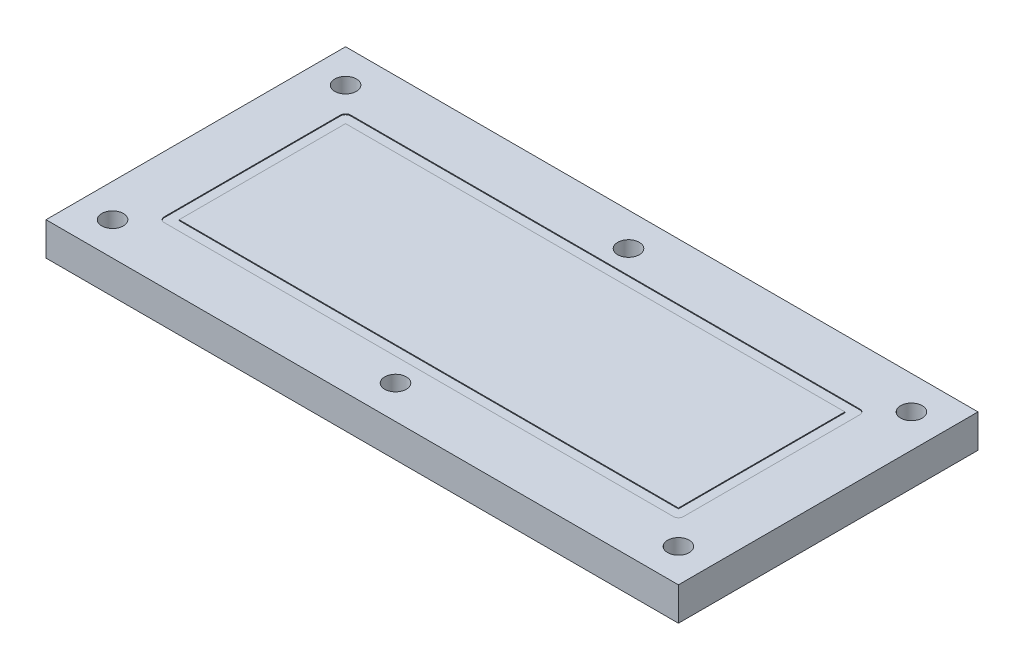
ISO-10303-21;
HEADER;
FILE_DESCRIPTION(('STEP AP214'),'2;1');
FILE_NAME('part.step','',(''),(''),'','','');
FILE_SCHEMA(('AUTOMOTIVE_DESIGN { 1 0 10303 214 1 1 1 1 }'));
ENDSEC;
DATA;
#1=APPLICATION_CONTEXT('core data for automotive mechanical design processes');
#2=APPLICATION_PROTOCOL_DEFINITION('international standard','automotive_design',2000,#1);
#3=PRODUCT_CONTEXT('',#1,'mechanical');
#4=PRODUCT('Part','Part','',(#3));
#5=PRODUCT_RELATED_PRODUCT_CATEGORY('part','',(#4));
#6=PRODUCT_DEFINITION_FORMATION('','',#4);
#7=PRODUCT_DEFINITION_CONTEXT('part definition',#1,'design');
#8=PRODUCT_DEFINITION('design','',#6,#7);
#9=PRODUCT_DEFINITION_SHAPE('','',#8);
#10=(LENGTH_UNIT() NAMED_UNIT(*) SI_UNIT(.MILLI.,.METRE.));
#11=(NAMED_UNIT(*) PLANE_ANGLE_UNIT() SI_UNIT($,.RADIAN.));
#12=(NAMED_UNIT(*) SI_UNIT($,.STERADIAN.) SOLID_ANGLE_UNIT());
#13=UNCERTAINTY_MEASURE_WITH_UNIT(LENGTH_MEASURE(1.E-05),#10,'distance_accuracy_value','');
#14=(GEOMETRIC_REPRESENTATION_CONTEXT(3) GLOBAL_UNCERTAINTY_ASSIGNED_CONTEXT((#13)) GLOBAL_UNIT_ASSIGNED_CONTEXT((#10,
#11,#12)) REPRESENTATION_CONTEXT('',''));
#15=CARTESIAN_POINT('',(0.,0.,0.));
#16=DIRECTION('',(0.,0.,1.));
#17=DIRECTION('',(1.,0.,0.));
#18=AXIS2_PLACEMENT_3D('',#15,#16,#17);
#19=CARTESIAN_POINT('',(190.,20.,90.));
#20=DIRECTION('',(-1.,0.,0.));
#21=DIRECTION('',(0.,0.,1.));
#22=AXIS2_PLACEMENT_3D('',#19,#20,#21);
#23=PLANE('',#22);
#24=DIRECTION('',(0.,0.,-1.));
#25=VECTOR('',#24,1.);
#26=CARTESIAN_POINT('',(190.,0.,90.));
#27=LINE('',#26,#25);
#28=CARTESIAN_POINT('',(190.,0.,90.));
#29=VERTEX_POINT('',#28);
#30=CARTESIAN_POINT('',(190.,0.,-90.));
#31=VERTEX_POINT('',#30);
#32=EDGE_CURVE('E285',#29,#31,#27,.T.);
#33=ORIENTED_EDGE('',*,*,#32,.T.);
#34=DIRECTION('',(0.,-1.,0.));
#35=VECTOR('',#34,1.);
#36=CARTESIAN_POINT('',(190.,20.,-90.));
#37=LINE('',#36,#35);
#38=CARTESIAN_POINT('',(190.,20.,-90.));
#39=VERTEX_POINT('',#38);
#40=EDGE_CURVE('E11',#39,#31,#37,.T.);
#41=ORIENTED_EDGE('',*,*,#40,.F.);
#42=DIRECTION('',(0.,0.,-1.));
#43=VECTOR('',#42,1.);
#44=CARTESIAN_POINT('',(190.,20.,90.));
#45=LINE('',#44,#43);
#46=CARTESIAN_POINT('',(190.,20.,90.));
#47=VERTEX_POINT('',#46);
#48=EDGE_CURVE('E288',#47,#39,#45,.T.);
#49=ORIENTED_EDGE('',*,*,#48,.F.);
#50=DIRECTION('',(0.,-1.,0.));
#51=VECTOR('',#50,1.);
#52=CARTESIAN_POINT('',(190.,20.,90.));
#53=LINE('',#52,#51);
#54=EDGE_CURVE('E298',#47,#29,#53,.T.);
#55=ORIENTED_EDGE('',*,*,#54,.T.);
#56=EDGE_LOOP('',(#33,#41,#49,#55));
#57=FACE_BOUND('',#56,.T.);
#58=ADVANCED_FACE('F36',(#57),#23,.F.);
#59=CARTESIAN_POINT('',(-190.,20.,-90.));
#60=DIRECTION('',(0.,0.,1.));
#61=DIRECTION('',(1.,0.,0.));
#62=AXIS2_PLACEMENT_3D('',#59,#60,#61);
#63=PLANE('',#62);
#64=DIRECTION('',(-1.,0.,0.));
#65=VECTOR('',#64,1.);
#66=CARTESIAN_POINT('',(-190.,0.,-90.));
#67=LINE('',#66,#65);
#68=CARTESIAN_POINT('',(-190.,0.,-90.));
#69=VERTEX_POINT('',#68);
#70=EDGE_CURVE('E301',#31,#69,#67,.T.);
#71=ORIENTED_EDGE('',*,*,#70,.T.);
#72=DIRECTION('',(0.,-1.,0.));
#73=VECTOR('',#72,1.);
#74=CARTESIAN_POINT('',(-190.,20.,-90.));
#75=LINE('',#74,#73);
#76=CARTESIAN_POINT('',(-190.,20.,-90.));
#77=VERTEX_POINT('',#76);
#78=EDGE_CURVE('E43',#77,#69,#75,.T.);
#79=ORIENTED_EDGE('',*,*,#78,.F.);
#80=DIRECTION('',(-1.,0.,0.));
#81=VECTOR('',#80,1.);
#82=CARTESIAN_POINT('',(-190.,20.,-90.));
#83=LINE('',#82,#81);
#84=EDGE_CURVE('E291',#39,#77,#83,.T.);
#85=ORIENTED_EDGE('',*,*,#84,.F.);
#86=ORIENTED_EDGE('',*,*,#40,.T.);
#87=EDGE_LOOP('',(#71,#79,#85,#86));
#88=FACE_BOUND('',#87,.T.);
#89=ADVANCED_FACE('F331',(#88),#63,.F.);
#90=CARTESIAN_POINT('',(-190.,20.,90.));
#91=DIRECTION('',(1.,0.,0.));
#92=DIRECTION('',(0.,0.,-1.));
#93=AXIS2_PLACEMENT_3D('',#90,#91,#92);
#94=PLANE('',#93);
#95=DIRECTION('',(0.,0.,1.));
#96=VECTOR('',#95,1.);
#97=CARTESIAN_POINT('',(-190.,0.,90.));
#98=LINE('',#97,#96);
#99=CARTESIAN_POINT('',(-190.,0.,90.));
#100=VERTEX_POINT('',#99);
#101=EDGE_CURVE('E303',#69,#100,#98,.T.);
#102=ORIENTED_EDGE('',*,*,#101,.T.);
#103=DIRECTION('',(0.,-1.,0.));
#104=VECTOR('',#103,1.);
#105=CARTESIAN_POINT('',(-190.,20.,90.));
#106=LINE('',#105,#104);
#107=CARTESIAN_POINT('',(-190.,20.,90.));
#108=VERTEX_POINT('',#107);
#109=EDGE_CURVE('E308',#108,#100,#106,.T.);
#110=ORIENTED_EDGE('',*,*,#109,.F.);
#111=DIRECTION('',(0.,0.,1.));
#112=VECTOR('',#111,1.);
#113=CARTESIAN_POINT('',(-190.,20.,90.));
#114=LINE('',#113,#112);
#115=EDGE_CURVE('E294',#77,#108,#114,.T.);
#116=ORIENTED_EDGE('',*,*,#115,.F.);
#117=ORIENTED_EDGE('',*,*,#78,.T.);
#118=EDGE_LOOP('',(#102,#110,#116,#117));
#119=FACE_BOUND('',#118,.T.);
#120=ADVANCED_FACE('F315',(#119),#94,.F.);
#121=CARTESIAN_POINT('',(-190.,20.,90.));
#122=DIRECTION('',(0.,0.,-1.));
#123=DIRECTION('',(-1.,0.,0.));
#124=AXIS2_PLACEMENT_3D('',#121,#122,#123);
#125=PLANE('',#124);
#126=DIRECTION('',(1.,0.,0.));
#127=VECTOR('',#126,1.);
#128=CARTESIAN_POINT('',(-190.,0.,90.));
#129=LINE('',#128,#127);
#130=EDGE_CURVE('E292',#100,#29,#129,.T.);
#131=ORIENTED_EDGE('',*,*,#130,.T.);
#132=ORIENTED_EDGE('',*,*,#54,.F.);
#133=DIRECTION('',(1.,0.,0.));
#134=VECTOR('',#133,1.);
#135=CARTESIAN_POINT('',(-190.,20.,90.));
#136=LINE('',#135,#134);
#137=EDGE_CURVE('E296',#108,#47,#136,.T.);
#138=ORIENTED_EDGE('',*,*,#137,.F.);
#139=ORIENTED_EDGE('',*,*,#109,.T.);
#140=EDGE_LOOP('',(#131,#132,#138,#139));
#141=FACE_BOUND('',#140,.T.);
#142=ADVANCED_FACE('F324',(#141),#125,.F.);
#143=CARTESIAN_POINT('',(0.,20.,0.));
#144=DIRECTION('',(0.,-1.,0.));
#145=DIRECTION('',(0.,0.,-1.));
#146=AXIS2_PLACEMENT_3D('',#143,#144,#145);
#147=PLANE('',#146);
#148=DIRECTION('',(-1.,0.,0.));
#149=VECTOR('',#148,1.);
#150=CARTESIAN_POINT('',(-153.,20.,-56.));
#151=LINE('',#150,#149);
#152=CARTESIAN_POINT('',(153.,20.,-56.));
#153=VERTEX_POINT('',#152);
#154=CARTESIAN_POINT('',(-153.,20.,-56.));
#155=VERTEX_POINT('',#154);
#156=EDGE_CURVE('E216',#153,#155,#151,.T.);
#157=ORIENTED_EDGE('',*,*,#156,.F.);
#158=CARTESIAN_POINT('',(153.,20.,-53.));
#159=DIRECTION('',(0.,1.,0.));
#160=DIRECTION('',(0.,0.,-1.));
#161=AXIS2_PLACEMENT_3D('',#158,#159,#160);
#162=CIRCLE('',#161,3.);
#163=CARTESIAN_POINT('',(156.,20.,-53.));
#164=VERTEX_POINT('',#163);
#165=EDGE_CURVE('E50',#164,#153,#162,.T.);
#166=ORIENTED_EDGE('',*,*,#165,.F.);
#167=DIRECTION('',(0.,0.,-1.));
#168=VECTOR('',#167,1.);
#169=CARTESIAN_POINT('',(156.,20.,52.9999999999999));
#170=LINE('',#169,#168);
#171=CARTESIAN_POINT('',(156.,20.,52.9999999999999));
#172=VERTEX_POINT('',#171);
#173=EDGE_CURVE('E193',#172,#164,#170,.T.);
#174=ORIENTED_EDGE('',*,*,#173,.F.);
#175=CARTESIAN_POINT('',(153.,20.,52.9999999999999));
#176=DIRECTION('',(0.,1.,0.));
#177=DIRECTION('',(0.,0.,1.));
#178=AXIS2_PLACEMENT_3D('',#175,#176,#177);
#179=CIRCLE('',#178,3.);
#180=CARTESIAN_POINT('',(153.,20.,55.9999999999999));
#181=VERTEX_POINT('',#180);
#182=EDGE_CURVE('E231',#181,#172,#179,.T.);
#183=ORIENTED_EDGE('',*,*,#182,.F.);
#184=DIRECTION('',(1.,0.,0.));
#185=VECTOR('',#184,1.);
#186=CARTESIAN_POINT('',(-153.,20.,55.9999999999999));
#187=LINE('',#186,#185);
#188=CARTESIAN_POINT('',(-153.,20.,55.9999999999999));
#189=VERTEX_POINT('',#188);
#190=EDGE_CURVE('E228',#189,#181,#187,.T.);
#191=ORIENTED_EDGE('',*,*,#190,.F.);
#192=CARTESIAN_POINT('',(-153.,20.,52.9999999999999));
#193=DIRECTION('',(0.,1.,0.));
#194=DIRECTION('',(0.,0.,-1.));
#195=AXIS2_PLACEMENT_3D('',#192,#193,#194);
#196=CIRCLE('',#195,3.);
#197=CARTESIAN_POINT('',(-156.,20.,52.9999999999999));
#198=VERTEX_POINT('',#197);
#199=EDGE_CURVE('E225',#198,#189,#196,.T.);
#200=ORIENTED_EDGE('',*,*,#199,.F.);
#201=DIRECTION('',(0.,0.,1.));
#202=VECTOR('',#201,1.);
#203=CARTESIAN_POINT('',(-156.,20.,52.9999999999999));
#204=LINE('',#203,#202);
#205=CARTESIAN_POINT('',(-156.,20.,-53.));
#206=VERTEX_POINT('',#205);
#207=EDGE_CURVE('E222',#206,#198,#204,.T.);
#208=ORIENTED_EDGE('',*,*,#207,.F.);
#209=CARTESIAN_POINT('',(-153.,20.,-53.));
#210=DIRECTION('',(0.,1.,0.));
#211=DIRECTION('',(0.,0.,-1.));
#212=AXIS2_PLACEMENT_3D('',#209,#210,#211);
#213=CIRCLE('',#212,3.);
#214=EDGE_CURVE('E219',#155,#206,#213,.T.);
#215=ORIENTED_EDGE('',*,*,#214,.F.);
#216=EDGE_LOOP('',(#157,#166,#174,#183,#191,#200,#208,#215));
#217=FACE_BOUND('',#216,.T.);
#218=CARTESIAN_POINT('',(170.,20.,70.));
#219=DIRECTION('',(0.,1.,0.));
#220=DIRECTION('',(0.,0.,-1.));
#221=AXIS2_PLACEMENT_3D('',#218,#219,#220);
#222=CIRCLE('',#221,6.50000000000002);
#223=CARTESIAN_POINT('',(170.,20.,63.5));
#224=VERTEX_POINT('',#223);
#225=EDGE_CURVE('E255',#224,#224,#222,.T.);
#226=ORIENTED_EDGE('',*,*,#225,.F.);
#227=EDGE_LOOP('',(#226));
#228=FACE_BOUND('',#227,.T.);
#229=CARTESIAN_POINT('',(0.,20.,-70.));
#230=DIRECTION('',(0.,1.,0.));
#231=DIRECTION('',(0.,0.,1.));
#232=AXIS2_PLACEMENT_3D('',#229,#230,#231);
#233=CIRCLE('',#232,6.50000000000001);
#234=CARTESIAN_POINT('',(0.,20.,-63.5));
#235=VERTEX_POINT('',#234);
#236=EDGE_CURVE('E262',#235,#235,#233,.T.);
#237=ORIENTED_EDGE('',*,*,#236,.F.);
#238=EDGE_LOOP('',(#237));
#239=FACE_BOUND('',#238,.T.);
#240=CARTESIAN_POINT('',(0.,20.,70.));
#241=DIRECTION('',(0.,1.,0.));
#242=DIRECTION('',(0.,0.,1.));
#243=AXIS2_PLACEMENT_3D('',#240,#241,#242);
#244=CIRCLE('',#243,6.5);
#245=CARTESIAN_POINT('',(0.,20.,76.5));
#246=VERTEX_POINT('',#245);
#247=EDGE_CURVE('E261',#246,#246,#244,.T.);
#248=ORIENTED_EDGE('',*,*,#247,.F.);
#249=EDGE_LOOP('',(#248));
#250=FACE_BOUND('',#249,.T.);
#251=CARTESIAN_POINT('',(-170.,20.,70.));
#252=DIRECTION('',(0.,1.,0.));
#253=DIRECTION('',(0.,0.,1.));
#254=AXIS2_PLACEMENT_3D('',#251,#252,#253);
#255=CIRCLE('',#254,6.50000000000002);
#256=CARTESIAN_POINT('',(-170.,20.,76.5));
#257=VERTEX_POINT('',#256);
#258=EDGE_CURVE('E274',#257,#257,#255,.T.);
#259=ORIENTED_EDGE('',*,*,#258,.F.);
#260=EDGE_LOOP('',(#259));
#261=FACE_BOUND('',#260,.T.);
#262=CARTESIAN_POINT('',(170.,20.,-70.));
#263=DIRECTION('',(0.,1.,0.));
#264=DIRECTION('',(0.,0.,-1.));
#265=AXIS2_PLACEMENT_3D('',#262,#263,#264);
#266=CIRCLE('',#265,6.50000000000002);
#267=CARTESIAN_POINT('',(170.,20.,-76.5));
#268=VERTEX_POINT('',#267);
#269=EDGE_CURVE('E238',#268,#268,#266,.T.);
#270=ORIENTED_EDGE('',*,*,#269,.F.);
#271=EDGE_LOOP('',(#270));
#272=FACE_BOUND('',#271,.T.);
#273=CARTESIAN_POINT('',(-170.,20.,-70.));
#274=DIRECTION('',(0.,1.,0.));
#275=DIRECTION('',(0.,0.,1.));
#276=AXIS2_PLACEMENT_3D('',#273,#274,#275);
#277=CIRCLE('',#276,6.50000000000002);
#278=CARTESIAN_POINT('',(-170.,20.,-63.5));
#279=VERTEX_POINT('',#278);
#280=EDGE_CURVE('E273',#279,#279,#277,.T.);
#281=ORIENTED_EDGE('',*,*,#280,.F.);
#282=EDGE_LOOP('',(#281));
#283=FACE_BOUND('',#282,.T.);
#284=ORIENTED_EDGE('',*,*,#48,.T.);
#285=ORIENTED_EDGE('',*,*,#84,.T.);
#286=ORIENTED_EDGE('',*,*,#115,.T.);
#287=ORIENTED_EDGE('',*,*,#137,.T.);
#288=EDGE_LOOP('',(#284,#285,#286,#287));
#289=FACE_BOUND('',#288,.T.);
#290=ADVANCED_FACE('F330',(#217,#228,#239,#250,#261,#272,#283,#289),#147,.F.);
#291=CARTESIAN_POINT('',(0.,0.,0.));
#292=DIRECTION('',(0.,-1.,0.));
#293=DIRECTION('',(0.,0.,-1.));
#294=AXIS2_PLACEMENT_3D('',#291,#292,#293);
#295=PLANE('',#294);
#296=CARTESIAN_POINT('',(170.,0.,70.));
#297=DIRECTION('',(0.,1.,0.));
#298=DIRECTION('',(0.,0.,-1.));
#299=AXIS2_PLACEMENT_3D('',#296,#297,#298);
#300=CIRCLE('',#299,6.50000000000002);
#301=CARTESIAN_POINT('',(170.,0.,63.5));
#302=VERTEX_POINT('',#301);
#303=EDGE_CURVE('E265',#302,#302,#300,.T.);
#304=ORIENTED_EDGE('',*,*,#303,.T.);
#305=EDGE_LOOP('',(#304));
#306=FACE_BOUND('',#305,.T.);
#307=CARTESIAN_POINT('',(0.,0.,-70.));
#308=DIRECTION('',(0.,1.,0.));
#309=DIRECTION('',(0.,0.,1.));
#310=AXIS2_PLACEMENT_3D('',#307,#308,#309);
#311=CIRCLE('',#310,6.50000000000001);
#312=CARTESIAN_POINT('',(0.,0.,-63.5));
#313=VERTEX_POINT('',#312);
#314=EDGE_CURVE('E258',#313,#313,#311,.T.);
#315=ORIENTED_EDGE('',*,*,#314,.T.);
#316=EDGE_LOOP('',(#315));
#317=FACE_BOUND('',#316,.T.);
#318=CARTESIAN_POINT('',(0.,0.,70.));
#319=DIRECTION('',(0.,1.,0.));
#320=DIRECTION('',(0.,0.,1.));
#321=AXIS2_PLACEMENT_3D('',#318,#319,#320);
#322=CIRCLE('',#321,6.5);
#323=CARTESIAN_POINT('',(0.,0.,76.5));
#324=VERTEX_POINT('',#323);
#325=EDGE_CURVE('E277',#324,#324,#322,.T.);
#326=ORIENTED_EDGE('',*,*,#325,.T.);
#327=EDGE_LOOP('',(#326));
#328=FACE_BOUND('',#327,.T.);
#329=CARTESIAN_POINT('',(-170.,0.,70.));
#330=DIRECTION('',(0.,1.,0.));
#331=DIRECTION('',(0.,0.,1.));
#332=AXIS2_PLACEMENT_3D('',#329,#330,#331);
#333=CIRCLE('',#332,6.50000000000002);
#334=CARTESIAN_POINT('',(-170.,0.,76.5));
#335=VERTEX_POINT('',#334);
#336=EDGE_CURVE('E270',#335,#335,#333,.T.);
#337=ORIENTED_EDGE('',*,*,#336,.T.);
#338=EDGE_LOOP('',(#337));
#339=FACE_BOUND('',#338,.T.);
#340=CARTESIAN_POINT('',(170.,0.,-70.));
#341=DIRECTION('',(0.,1.,0.));
#342=DIRECTION('',(0.,0.,-1.));
#343=AXIS2_PLACEMENT_3D('',#340,#341,#342);
#344=CIRCLE('',#343,6.50000000000002);
#345=CARTESIAN_POINT('',(170.,0.,-76.5));
#346=VERTEX_POINT('',#345);
#347=EDGE_CURVE('E252',#346,#346,#344,.T.);
#348=ORIENTED_EDGE('',*,*,#347,.T.);
#349=EDGE_LOOP('',(#348));
#350=FACE_BOUND('',#349,.T.);
#351=CARTESIAN_POINT('',(-170.,0.,-70.));
#352=DIRECTION('',(0.,1.,0.));
#353=DIRECTION('',(0.,0.,1.));
#354=AXIS2_PLACEMENT_3D('',#351,#352,#353);
#355=CIRCLE('',#354,6.50000000000002);
#356=CARTESIAN_POINT('',(-170.,0.,-63.5));
#357=VERTEX_POINT('',#356);
#358=EDGE_CURVE('E282',#357,#357,#355,.T.);
#359=ORIENTED_EDGE('',*,*,#358,.T.);
#360=EDGE_LOOP('',(#359));
#361=FACE_BOUND('',#360,.T.);
#362=ORIENTED_EDGE('',*,*,#32,.F.);
#363=ORIENTED_EDGE('',*,*,#130,.F.);
#364=ORIENTED_EDGE('',*,*,#101,.F.);
#365=ORIENTED_EDGE('',*,*,#70,.F.);
#366=EDGE_LOOP('',(#362,#363,#364,#365));
#367=FACE_BOUND('',#366,.T.);
#368=ADVANCED_FACE('F321',(#306,#317,#328,#339,#350,#361,#367),#295,.T.);
#369=CARTESIAN_POINT('',(-170.,0.,-70.));
#370=DIRECTION('',(0.,1.,0.));
#371=DIRECTION('',(0.,0.,1.));
#372=AXIS2_PLACEMENT_3D('',#369,#370,#371);
#373=CYLINDRICAL_SURFACE('',#372,6.50000000000002);
#374=ORIENTED_EDGE('',*,*,#358,.F.);
#375=EDGE_LOOP('',(#374));
#376=FACE_BOUND('',#375,.T.);
#377=ORIENTED_EDGE('',*,*,#280,.T.);
#378=EDGE_LOOP('',(#377));
#379=FACE_BOUND('',#378,.T.);
#380=ADVANCED_FACE('F343',(#376,#379),#373,.F.);
#381=CARTESIAN_POINT('',(170.,0.,-70.));
#382=DIRECTION('',(0.,1.,0.));
#383=DIRECTION('',(0.,0.,1.));
#384=AXIS2_PLACEMENT_3D('',#381,#382,#383);
#385=CYLINDRICAL_SURFACE('',#384,6.50000000000002);
#386=ORIENTED_EDGE('',*,*,#347,.F.);
#387=EDGE_LOOP('',(#386));
#388=FACE_BOUND('',#387,.T.);
#389=ORIENTED_EDGE('',*,*,#269,.T.);
#390=EDGE_LOOP('',(#389));
#391=FACE_BOUND('',#390,.T.);
#392=ADVANCED_FACE('F351',(#388,#391),#385,.F.);
#393=CARTESIAN_POINT('',(-170.,0.,70.));
#394=DIRECTION('',(0.,1.,0.));
#395=DIRECTION('',(0.,0.,1.));
#396=AXIS2_PLACEMENT_3D('',#393,#394,#395);
#397=CYLINDRICAL_SURFACE('',#396,6.50000000000002);
#398=ORIENTED_EDGE('',*,*,#336,.F.);
#399=EDGE_LOOP('',(#398));
#400=FACE_BOUND('',#399,.T.);
#401=ORIENTED_EDGE('',*,*,#258,.T.);
#402=EDGE_LOOP('',(#401));
#403=FACE_BOUND('',#402,.T.);
#404=ADVANCED_FACE('F357',(#400,#403),#397,.F.);
#405=CARTESIAN_POINT('',(0.,0.,70.));
#406=DIRECTION('',(0.,1.,0.));
#407=DIRECTION('',(0.,0.,1.));
#408=AXIS2_PLACEMENT_3D('',#405,#406,#407);
#409=CYLINDRICAL_SURFACE('',#408,6.5);
#410=ORIENTED_EDGE('',*,*,#325,.F.);
#411=EDGE_LOOP('',(#410));
#412=FACE_BOUND('',#411,.T.);
#413=ORIENTED_EDGE('',*,*,#247,.T.);
#414=EDGE_LOOP('',(#413));
#415=FACE_BOUND('',#414,.T.);
#416=ADVANCED_FACE('F353',(#412,#415),#409,.F.);
#417=CARTESIAN_POINT('',(0.,0.,-70.));
#418=DIRECTION('',(0.,1.,0.));
#419=DIRECTION('',(0.,0.,1.));
#420=AXIS2_PLACEMENT_3D('',#417,#418,#419);
#421=CYLINDRICAL_SURFACE('',#420,6.50000000000001);
#422=ORIENTED_EDGE('',*,*,#314,.F.);
#423=EDGE_LOOP('',(#422));
#424=FACE_BOUND('',#423,.T.);
#425=ORIENTED_EDGE('',*,*,#236,.T.);
#426=EDGE_LOOP('',(#425));
#427=FACE_BOUND('',#426,.T.);
#428=ADVANCED_FACE('F356',(#424,#427),#421,.F.);
#429=CARTESIAN_POINT('',(170.,0.,70.));
#430=DIRECTION('',(0.,1.,0.));
#431=DIRECTION('',(0.,0.,1.));
#432=AXIS2_PLACEMENT_3D('',#429,#430,#431);
#433=CYLINDRICAL_SURFACE('',#432,6.50000000000002);
#434=ORIENTED_EDGE('',*,*,#303,.F.);
#435=EDGE_LOOP('',(#434));
#436=FACE_BOUND('',#435,.T.);
#437=ORIENTED_EDGE('',*,*,#225,.T.);
#438=EDGE_LOOP('',(#437));
#439=FACE_BOUND('',#438,.T.);
#440=ADVANCED_FACE('F362',(#436,#439),#433,.F.);
#441=CARTESIAN_POINT('',(153.,19.5,-53.));
#442=DIRECTION('',(0.,1.,0.));
#443=DIRECTION('',(0.,0.,1.));
#444=AXIS2_PLACEMENT_3D('',#441,#442,#443);
#445=CYLINDRICAL_SURFACE('',#444,3.);
#446=ORIENTED_EDGE('',*,*,#165,.T.);
#447=DIRECTION('',(0.,1.,0.));
#448=VECTOR('',#447,1.);
#449=CARTESIAN_POINT('',(153.,19.5,-56.));
#450=LINE('',#449,#448);
#451=CARTESIAN_POINT('',(153.,19.5,-56.));
#452=VERTEX_POINT('',#451);
#453=EDGE_CURVE('E214',#452,#153,#450,.T.);
#454=ORIENTED_EDGE('',*,*,#453,.F.);
#455=CARTESIAN_POINT('',(153.,19.5,-53.));
#456=DIRECTION('',(0.,1.,0.));
#457=DIRECTION('',(0.,0.,-1.));
#458=AXIS2_PLACEMENT_3D('',#455,#456,#457);
#459=CIRCLE('',#458,3.);
#460=CARTESIAN_POINT('',(156.,19.5,-53.));
#461=VERTEX_POINT('',#460);
#462=EDGE_CURVE('E189',#461,#452,#459,.T.);
#463=ORIENTED_EDGE('',*,*,#462,.F.);
#464=DIRECTION('',(0.,1.,0.));
#465=VECTOR('',#464,1.);
#466=CARTESIAN_POINT('',(156.,19.5,-53.));
#467=LINE('',#466,#465);
#468=EDGE_CURVE('E236',#461,#164,#467,.T.);
#469=ORIENTED_EDGE('',*,*,#468,.T.);
#470=EDGE_LOOP('',(#446,#454,#463,#469));
#471=FACE_BOUND('',#470,.T.);
#472=ADVANCED_FACE('F365',(#471),#445,.F.);
#473=CARTESIAN_POINT('',(156.,19.5,52.9999999999999));
#474=DIRECTION('',(1.,0.,0.));
#475=DIRECTION('',(0.,0.,-1.));
#476=AXIS2_PLACEMENT_3D('',#473,#474,#475);
#477=PLANE('',#476);
#478=ORIENTED_EDGE('',*,*,#173,.T.);
#479=ORIENTED_EDGE('',*,*,#468,.F.);
#480=DIRECTION('',(0.,0.,-1.));
#481=VECTOR('',#480,1.);
#482=CARTESIAN_POINT('',(156.,19.5,52.9999999999999));
#483=LINE('',#482,#481);
#484=CARTESIAN_POINT('',(156.,19.5,52.9999999999999));
#485=VERTEX_POINT('',#484);
#486=EDGE_CURVE('E211',#485,#461,#483,.T.);
#487=ORIENTED_EDGE('',*,*,#486,.F.);
#488=DIRECTION('',(0.,1.,0.));
#489=VECTOR('',#488,1.);
#490=CARTESIAN_POINT('',(156.,19.5,52.9999999999999));
#491=LINE('',#490,#489);
#492=EDGE_CURVE('E239',#485,#172,#491,.T.);
#493=ORIENTED_EDGE('',*,*,#492,.T.);
#494=EDGE_LOOP('',(#478,#479,#487,#493));
#495=FACE_BOUND('',#494,.T.);
#496=ADVANCED_FACE('F375',(#495),#477,.F.);
#497=CARTESIAN_POINT('',(153.,19.5,52.9999999999999));
#498=DIRECTION('',(0.,1.,0.));
#499=DIRECTION('',(0.,0.,1.));
#500=AXIS2_PLACEMENT_3D('',#497,#498,#499);
#501=CYLINDRICAL_SURFACE('',#500,3.);
#502=ORIENTED_EDGE('',*,*,#182,.T.);
#503=ORIENTED_EDGE('',*,*,#492,.F.);
#504=CARTESIAN_POINT('',(153.,19.5,52.9999999999999));
#505=DIRECTION('',(0.,1.,0.));
#506=DIRECTION('',(0.,0.,1.));
#507=AXIS2_PLACEMENT_3D('',#504,#505,#506);
#508=CIRCLE('',#507,3.);
#509=CARTESIAN_POINT('',(153.,19.5,55.9999999999999));
#510=VERTEX_POINT('',#509);
#511=EDGE_CURVE('E208',#510,#485,#508,.T.);
#512=ORIENTED_EDGE('',*,*,#511,.F.);
#513=DIRECTION('',(0.,1.,0.));
#514=VECTOR('',#513,1.);
#515=CARTESIAN_POINT('',(153.,19.5,55.9999999999999));
#516=LINE('',#515,#514);
#517=EDGE_CURVE('E241',#510,#181,#516,.T.);
#518=ORIENTED_EDGE('',*,*,#517,.T.);
#519=EDGE_LOOP('',(#502,#503,#512,#518));
#520=FACE_BOUND('',#519,.T.);
#521=ADVANCED_FACE('F395',(#520),#501,.F.);
#522=CARTESIAN_POINT('',(-153.,19.5,55.9999999999999));
#523=DIRECTION('',(0.,0.,1.));
#524=DIRECTION('',(1.,0.,0.));
#525=AXIS2_PLACEMENT_3D('',#522,#523,#524);
#526=PLANE('',#525);
#527=ORIENTED_EDGE('',*,*,#190,.T.);
#528=ORIENTED_EDGE('',*,*,#517,.F.);
#529=DIRECTION('',(1.,0.,0.));
#530=VECTOR('',#529,1.);
#531=CARTESIAN_POINT('',(-153.,19.5,55.9999999999999));
#532=LINE('',#531,#530);
#533=CARTESIAN_POINT('',(-153.,19.5,55.9999999999999));
#534=VERTEX_POINT('',#533);
#535=EDGE_CURVE('E205',#534,#510,#532,.T.);
#536=ORIENTED_EDGE('',*,*,#535,.F.);
#537=DIRECTION('',(0.,1.,0.));
#538=VECTOR('',#537,1.);
#539=CARTESIAN_POINT('',(-153.,19.5,55.9999999999999));
#540=LINE('',#539,#538);
#541=EDGE_CURVE('E243',#534,#189,#540,.T.);
#542=ORIENTED_EDGE('',*,*,#541,.T.);
#543=EDGE_LOOP('',(#527,#528,#536,#542));
#544=FACE_BOUND('',#543,.T.);
#545=ADVANCED_FACE('F391',(#544),#526,.F.);
#546=CARTESIAN_POINT('',(-153.,19.5,52.9999999999999));
#547=DIRECTION('',(0.,1.,0.));
#548=DIRECTION('',(0.,0.,1.));
#549=AXIS2_PLACEMENT_3D('',#546,#547,#548);
#550=CYLINDRICAL_SURFACE('',#549,3.);
#551=ORIENTED_EDGE('',*,*,#199,.T.);
#552=ORIENTED_EDGE('',*,*,#541,.F.);
#553=CARTESIAN_POINT('',(-153.,19.5,52.9999999999999));
#554=DIRECTION('',(0.,1.,0.));
#555=DIRECTION('',(0.,0.,-1.));
#556=AXIS2_PLACEMENT_3D('',#553,#554,#555);
#557=CIRCLE('',#556,3.);
#558=CARTESIAN_POINT('',(-156.,19.5,52.9999999999999));
#559=VERTEX_POINT('',#558);
#560=EDGE_CURVE('E202',#559,#534,#557,.T.);
#561=ORIENTED_EDGE('',*,*,#560,.F.);
#562=DIRECTION('',(0.,1.,0.));
#563=VECTOR('',#562,1.);
#564=CARTESIAN_POINT('',(-156.,19.5,52.9999999999999));
#565=LINE('',#564,#563);
#566=EDGE_CURVE('E245',#559,#198,#565,.T.);
#567=ORIENTED_EDGE('',*,*,#566,.T.);
#568=EDGE_LOOP('',(#551,#552,#561,#567));
#569=FACE_BOUND('',#568,.T.);
#570=ADVANCED_FACE('F387',(#569),#550,.F.);
#571=CARTESIAN_POINT('',(-156.,19.5,52.9999999999999));
#572=DIRECTION('',(-1.,0.,0.));
#573=DIRECTION('',(0.,0.,1.));
#574=AXIS2_PLACEMENT_3D('',#571,#572,#573);
#575=PLANE('',#574);
#576=ORIENTED_EDGE('',*,*,#207,.T.);
#577=ORIENTED_EDGE('',*,*,#566,.F.);
#578=DIRECTION('',(0.,0.,1.));
#579=VECTOR('',#578,1.);
#580=CARTESIAN_POINT('',(-156.,19.5,52.9999999999999));
#581=LINE('',#580,#579);
#582=CARTESIAN_POINT('',(-156.,19.5,-53.));
#583=VERTEX_POINT('',#582);
#584=EDGE_CURVE('E199',#583,#559,#581,.T.);
#585=ORIENTED_EDGE('',*,*,#584,.F.);
#586=DIRECTION('',(0.,1.,0.));
#587=VECTOR('',#586,1.);
#588=CARTESIAN_POINT('',(-156.,19.5,-53.));
#589=LINE('',#588,#587);
#590=EDGE_CURVE('E247',#583,#206,#589,.T.);
#591=ORIENTED_EDGE('',*,*,#590,.T.);
#592=EDGE_LOOP('',(#576,#577,#585,#591));
#593=FACE_BOUND('',#592,.T.);
#594=ADVANCED_FACE('F383',(#593),#575,.F.);
#595=CARTESIAN_POINT('',(-153.,19.5,-53.));
#596=DIRECTION('',(0.,1.,0.));
#597=DIRECTION('',(0.,0.,1.));
#598=AXIS2_PLACEMENT_3D('',#595,#596,#597);
#599=CYLINDRICAL_SURFACE('',#598,3.);
#600=ORIENTED_EDGE('',*,*,#214,.T.);
#601=ORIENTED_EDGE('',*,*,#590,.F.);
#602=CARTESIAN_POINT('',(-153.,19.5,-53.));
#603=DIRECTION('',(0.,1.,0.));
#604=DIRECTION('',(0.,0.,-1.));
#605=AXIS2_PLACEMENT_3D('',#602,#603,#604);
#606=CIRCLE('',#605,3.);
#607=CARTESIAN_POINT('',(-153.,19.5,-56.));
#608=VERTEX_POINT('',#607);
#609=EDGE_CURVE('E196',#608,#583,#606,.T.);
#610=ORIENTED_EDGE('',*,*,#609,.F.);
#611=DIRECTION('',(0.,1.,0.));
#612=VECTOR('',#611,1.);
#613=CARTESIAN_POINT('',(-153.,19.5,-56.));
#614=LINE('',#613,#612);
#615=EDGE_CURVE('E249',#608,#155,#614,.T.);
#616=ORIENTED_EDGE('',*,*,#615,.T.);
#617=EDGE_LOOP('',(#600,#601,#610,#616));
#618=FACE_BOUND('',#617,.T.);
#619=ADVANCED_FACE('F379',(#618),#599,.F.);
#620=CARTESIAN_POINT('',(-153.,19.5,-56.));
#621=DIRECTION('',(0.,0.,-1.));
#622=DIRECTION('',(-1.,0.,0.));
#623=AXIS2_PLACEMENT_3D('',#620,#621,#622);
#624=PLANE('',#623);
#625=ORIENTED_EDGE('',*,*,#156,.T.);
#626=ORIENTED_EDGE('',*,*,#615,.F.);
#627=DIRECTION('',(-1.,0.,0.));
#628=VECTOR('',#627,1.);
#629=CARTESIAN_POINT('',(-153.,19.5,-56.));
#630=LINE('',#629,#628);
#631=EDGE_CURVE('E192',#452,#608,#630,.T.);
#632=ORIENTED_EDGE('',*,*,#631,.F.);
#633=ORIENTED_EDGE('',*,*,#453,.T.);
#634=EDGE_LOOP('',(#625,#626,#632,#633));
#635=FACE_BOUND('',#634,.T.);
#636=ADVANCED_FACE('F376',(#635),#624,.F.);
#637=CARTESIAN_POINT('',(153.,19.5,-53.));
#638=DIRECTION('',(0.,-1.,0.));
#639=DIRECTION('',(0.,0.,-1.));
#640=AXIS2_PLACEMENT_3D('',#637,#638,#639);
#641=PLANE('',#640);
#642=DIRECTION('',(0.,0.,-1.));
#643=VECTOR('',#642,1.);
#644=CARTESIAN_POINT('',(150.,19.5,50.));
#645=LINE('',#644,#643);
#646=CARTESIAN_POINT('',(150.,19.5,50.));
#647=VERTEX_POINT('',#646);
#648=CARTESIAN_POINT('',(150.,19.5,-50.));
#649=VERTEX_POINT('',#648);
#650=EDGE_CURVE('E167',#647,#649,#645,.T.);
#651=ORIENTED_EDGE('',*,*,#650,.F.);
#652=DIRECTION('',(1.,0.,0.));
#653=VECTOR('',#652,1.);
#654=CARTESIAN_POINT('',(-150.,19.5,50.));
#655=LINE('',#654,#653);
#656=CARTESIAN_POINT('',(-150.,19.5,50.));
#657=VERTEX_POINT('',#656);
#658=EDGE_CURVE('E160',#657,#647,#655,.T.);
#659=ORIENTED_EDGE('',*,*,#658,.F.);
#660=DIRECTION('',(0.,0.,1.));
#661=VECTOR('',#660,1.);
#662=CARTESIAN_POINT('',(-150.,19.5,50.));
#663=LINE('',#662,#661);
#664=CARTESIAN_POINT('',(-150.,19.5,-50.));
#665=VERTEX_POINT('',#664);
#666=EDGE_CURVE('E170',#665,#657,#663,.T.);
#667=ORIENTED_EDGE('',*,*,#666,.F.);
#668=DIRECTION('',(-1.,0.,0.));
#669=VECTOR('',#668,1.);
#670=CARTESIAN_POINT('',(-150.,19.5,-50.));
#671=LINE('',#670,#669);
#672=EDGE_CURVE('E152',#649,#665,#671,.T.);
#673=ORIENTED_EDGE('',*,*,#672,.F.);
#674=EDGE_LOOP('',(#651,#659,#667,#673));
#675=FACE_BOUND('',#674,.T.);
#676=ORIENTED_EDGE('',*,*,#462,.T.);
#677=ORIENTED_EDGE('',*,*,#631,.T.);
#678=ORIENTED_EDGE('',*,*,#609,.T.);
#679=ORIENTED_EDGE('',*,*,#584,.T.);
#680=ORIENTED_EDGE('',*,*,#560,.T.);
#681=ORIENTED_EDGE('',*,*,#535,.T.);
#682=ORIENTED_EDGE('',*,*,#511,.T.);
#683=ORIENTED_EDGE('',*,*,#486,.T.);
#684=EDGE_LOOP('',(#676,#677,#678,#679,#680,#681,#682,#683));
#685=FACE_BOUND('',#684,.T.);
#686=ADVANCED_FACE('F164',(#675,#685),#641,.F.);
#687=CARTESIAN_POINT('',(150.,19.5,50.));
#688=DIRECTION('',(1.,0.,0.));
#689=DIRECTION('',(0.,0.,-1.));
#690=AXIS2_PLACEMENT_3D('',#687,#688,#689);
#691=PLANE('',#690);
#692=DIRECTION('',(0.,0.,-1.));
#693=VECTOR('',#692,1.);
#694=CARTESIAN_POINT('',(150.,20.,50.));
#695=LINE('',#694,#693);
#696=CARTESIAN_POINT('',(150.,20.,50.));
#697=VERTEX_POINT('',#696);
#698=CARTESIAN_POINT('',(150.,20.,-50.));
#699=VERTEX_POINT('',#698);
#700=EDGE_CURVE('E181',#697,#699,#695,.T.);
#701=ORIENTED_EDGE('',*,*,#700,.F.);
#702=DIRECTION('',(0.,1.,0.));
#703=VECTOR('',#702,1.);
#704=CARTESIAN_POINT('',(150.,19.5,50.));
#705=LINE('',#704,#703);
#706=EDGE_CURVE('E173',#647,#697,#705,.T.);
#707=ORIENTED_EDGE('',*,*,#706,.F.);
#708=ORIENTED_EDGE('',*,*,#650,.T.);
#709=DIRECTION('',(0.,1.,0.));
#710=VECTOR('',#709,1.);
#711=CARTESIAN_POINT('',(150.,19.5,-50.));
#712=LINE('',#711,#710);
#713=EDGE_CURVE('E149',#649,#699,#712,.T.);
#714=ORIENTED_EDGE('',*,*,#713,.T.);
#715=EDGE_LOOP('',(#701,#707,#708,#714));
#716=FACE_BOUND('',#715,.T.);
#717=ADVANCED_FACE('F172',(#716),#691,.T.);
#718=CARTESIAN_POINT('',(-150.,19.5,50.));
#719=DIRECTION('',(0.,0.,1.));
#720=DIRECTION('',(1.,0.,0.));
#721=AXIS2_PLACEMENT_3D('',#718,#719,#720);
#722=PLANE('',#721);
#723=DIRECTION('',(1.,0.,0.));
#724=VECTOR('',#723,1.);
#725=CARTESIAN_POINT('',(-150.,20.,50.));
#726=LINE('',#725,#724);
#727=CARTESIAN_POINT('',(-150.,20.,50.));
#728=VERTEX_POINT('',#727);
#729=EDGE_CURVE('E174',#728,#697,#726,.T.);
#730=ORIENTED_EDGE('',*,*,#729,.F.);
#731=DIRECTION('',(0.,1.,0.));
#732=VECTOR('',#731,1.);
#733=CARTESIAN_POINT('',(-150.,19.5,50.));
#734=LINE('',#733,#732);
#735=EDGE_CURVE('E186',#657,#728,#734,.T.);
#736=ORIENTED_EDGE('',*,*,#735,.F.);
#737=ORIENTED_EDGE('',*,*,#658,.T.);
#738=ORIENTED_EDGE('',*,*,#706,.T.);
#739=EDGE_LOOP('',(#730,#736,#737,#738));
#740=FACE_BOUND('',#739,.T.);
#741=ADVANCED_FACE('F407',(#740),#722,.T.);
#742=CARTESIAN_POINT('',(-150.,19.5,50.));
#743=DIRECTION('',(-1.,0.,0.));
#744=DIRECTION('',(0.,0.,1.));
#745=AXIS2_PLACEMENT_3D('',#742,#743,#744);
#746=PLANE('',#745);
#747=DIRECTION('',(0.,0.,1.));
#748=VECTOR('',#747,1.);
#749=CARTESIAN_POINT('',(-150.,20.,50.));
#750=LINE('',#749,#748);
#751=CARTESIAN_POINT('',(-150.,20.,-50.));
#752=VERTEX_POINT('',#751);
#753=EDGE_CURVE('E58',#752,#728,#750,.T.);
#754=ORIENTED_EDGE('',*,*,#753,.F.);
#755=DIRECTION('',(0.,1.,0.));
#756=VECTOR('',#755,1.);
#757=CARTESIAN_POINT('',(-150.,19.5,-50.));
#758=LINE('',#757,#756);
#759=EDGE_CURVE('E159',#665,#752,#758,.T.);
#760=ORIENTED_EDGE('',*,*,#759,.F.);
#761=ORIENTED_EDGE('',*,*,#666,.T.);
#762=ORIENTED_EDGE('',*,*,#735,.T.);
#763=EDGE_LOOP('',(#754,#760,#761,#762));
#764=FACE_BOUND('',#763,.T.);
#765=ADVANCED_FACE('F410',(#764),#746,.T.);
#766=CARTESIAN_POINT('',(-150.,19.5,-50.));
#767=DIRECTION('',(0.,0.,-1.));
#768=DIRECTION('',(-1.,0.,0.));
#769=AXIS2_PLACEMENT_3D('',#766,#767,#768);
#770=PLANE('',#769);
#771=DIRECTION('',(-1.,0.,0.));
#772=VECTOR('',#771,1.);
#773=CARTESIAN_POINT('',(-150.,20.,-50.));
#774=LINE('',#773,#772);
#775=EDGE_CURVE('E154',#699,#752,#774,.T.);
#776=ORIENTED_EDGE('',*,*,#775,.F.);
#777=ORIENTED_EDGE('',*,*,#713,.F.);
#778=ORIENTED_EDGE('',*,*,#672,.T.);
#779=ORIENTED_EDGE('',*,*,#759,.T.);
#780=EDGE_LOOP('',(#776,#777,#778,#779));
#781=FACE_BOUND('',#780,.T.);
#782=ADVANCED_FACE('F151',(#781),#770,.T.);
#783=ORIENTED_EDGE('',*,*,#700,.T.);
#784=ORIENTED_EDGE('',*,*,#775,.T.);
#785=ORIENTED_EDGE('',*,*,#753,.T.);
#786=ORIENTED_EDGE('',*,*,#729,.T.);
#787=EDGE_LOOP('',(#783,#784,#785,#786));
#788=FACE_BOUND('',#787,.T.);
#789=ADVANCED_FACE('F348',(#788),#147,.F.);
#790=CLOSED_SHELL('',(#58,#89,#120,#142,#290,#368,#380,#392,#404,#416,#428,#440,#472,#496,#521,
#545,#570,#594,#619,#636,#686,#717,#741,#765,#782,#789));
#791=MANIFOLD_SOLID_BREP('B2',#790);
#792=ADVANCED_BREP_SHAPE_REPRESENTATION('',(#18,#791),#14);
#793=SHAPE_DEFINITION_REPRESENTATION(#9,#792);
ENDSEC;
END-ISO-10303-21;
